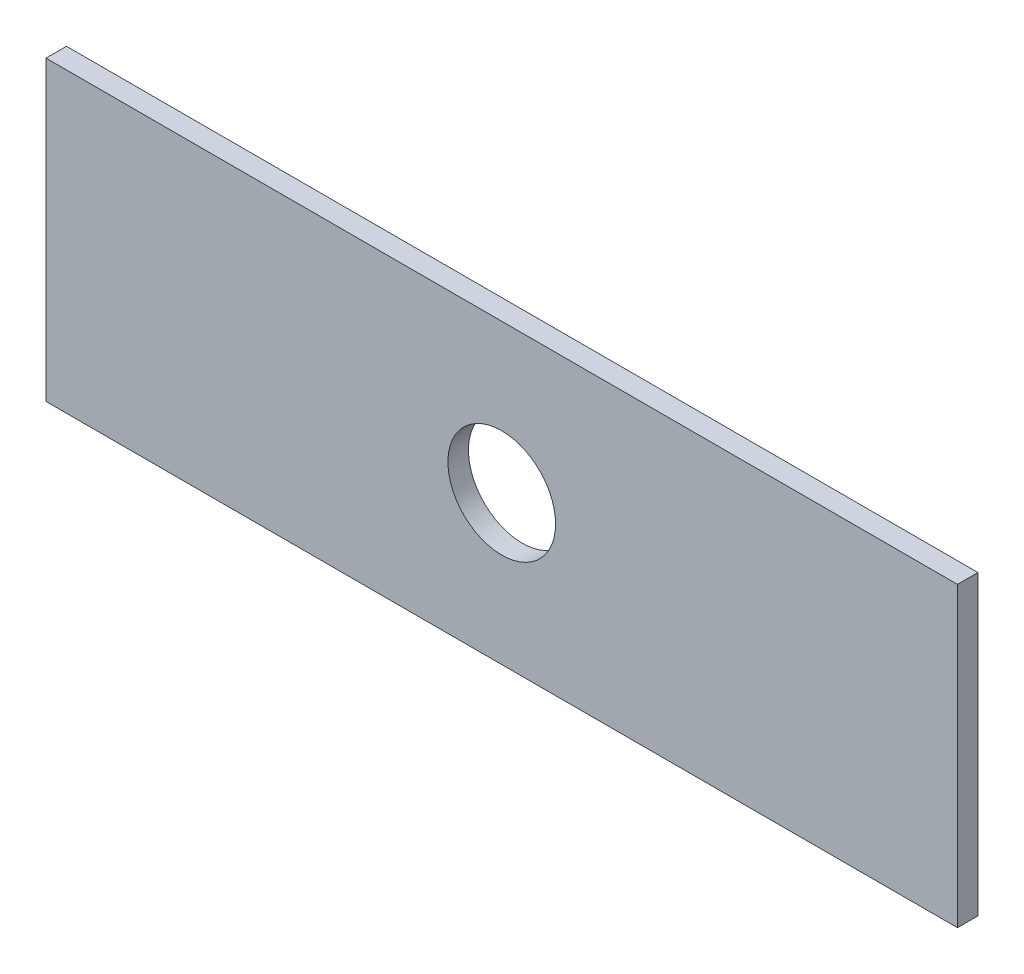
ISO-10303-21;
HEADER;
FILE_DESCRIPTION(('STEP AP214'),'2;1');
FILE_NAME('part.step','',(''),(''),'','','');
FILE_SCHEMA(('AUTOMOTIVE_DESIGN { 1 0 10303 214 1 1 1 1 }'));
ENDSEC;
DATA;
#1=APPLICATION_CONTEXT('core data for automotive mechanical design processes');
#2=APPLICATION_PROTOCOL_DEFINITION('international standard','automotive_design',2000,#1);
#3=PRODUCT_CONTEXT('',#1,'mechanical');
#4=PRODUCT('Part','Part','',(#3));
#5=PRODUCT_RELATED_PRODUCT_CATEGORY('part','',(#4));
#6=PRODUCT_DEFINITION_FORMATION('','',#4);
#7=PRODUCT_DEFINITION_CONTEXT('part definition',#1,'design');
#8=PRODUCT_DEFINITION('design','',#6,#7);
#9=PRODUCT_DEFINITION_SHAPE('','',#8);
#10=(LENGTH_UNIT() NAMED_UNIT(*) SI_UNIT(.MILLI.,.METRE.));
#11=(NAMED_UNIT(*) PLANE_ANGLE_UNIT() SI_UNIT($,.RADIAN.));
#12=(NAMED_UNIT(*) SI_UNIT($,.STERADIAN.) SOLID_ANGLE_UNIT());
#13=UNCERTAINTY_MEASURE_WITH_UNIT(LENGTH_MEASURE(1.E-05),#10,'distance_accuracy_value','');
#14=(GEOMETRIC_REPRESENTATION_CONTEXT(3) GLOBAL_UNCERTAINTY_ASSIGNED_CONTEXT((#13)) GLOBAL_UNIT_ASSIGNED_CONTEXT((#10,
#11,#12)) REPRESENTATION_CONTEXT('',''));
#15=CARTESIAN_POINT('',(0.,0.,0.));
#16=DIRECTION('',(0.,0.,1.));
#17=DIRECTION('',(1.,0.,0.));
#18=AXIS2_PLACEMENT_3D('',#15,#16,#17);
#19=CARTESIAN_POINT('',(-83.6741450916128,29.1859808723421,4.));
#20=DIRECTION('',(1.,0.,0.));
#21=DIRECTION('',(0.,0.,-1.));
#22=AXIS2_PLACEMENT_3D('',#19,#20,#21);
#23=PLANE('',#22);
#24=DIRECTION('',(0.,-1.,0.));
#25=VECTOR('',#24,1.);
#26=CARTESIAN_POINT('',(-83.6741450916128,29.1859808723421,0.));
#27=LINE('',#26,#25);
#28=CARTESIAN_POINT('',(-83.6741450916128,29.1859808723421,0.));
#29=VERTEX_POINT('',#28);
#30=CARTESIAN_POINT('',(-83.6741450916128,-28.814019127658,0.));
#31=VERTEX_POINT('',#30);
#32=EDGE_CURVE('E95',#29,#31,#27,.T.);
#33=ORIENTED_EDGE('',*,*,#32,.T.);
#34=DIRECTION('',(0.,0.,-1.));
#35=VECTOR('',#34,1.);
#36=CARTESIAN_POINT('',(-83.6741450916128,-28.814019127658,4.));
#37=LINE('',#36,#35);
#38=CARTESIAN_POINT('',(-83.6741450916128,-28.814019127658,4.));
#39=VERTEX_POINT('',#38);
#40=EDGE_CURVE('E11',#39,#31,#37,.T.);
#41=ORIENTED_EDGE('',*,*,#40,.F.);
#42=DIRECTION('',(0.,-1.,0.));
#43=VECTOR('',#42,1.);
#44=CARTESIAN_POINT('',(-83.6741450916128,29.1859808723421,4.));
#45=LINE('',#44,#43);
#46=CARTESIAN_POINT('',(-83.6741450916128,29.1859808723421,4.));
#47=VERTEX_POINT('',#46);
#48=EDGE_CURVE('E83',#47,#39,#45,.T.);
#49=ORIENTED_EDGE('',*,*,#48,.F.);
#50=DIRECTION('',(0.,0.,-1.));
#51=VECTOR('',#50,1.);
#52=CARTESIAN_POINT('',(-83.6741450916128,29.1859808723421,4.));
#53=LINE('',#52,#51);
#54=EDGE_CURVE('E91',#47,#29,#53,.T.);
#55=ORIENTED_EDGE('',*,*,#54,.T.);
#56=EDGE_LOOP('',(#33,#41,#49,#55));
#57=FACE_BOUND('',#56,.T.);
#58=ADVANCED_FACE('F32',(#57),#23,.F.);
#59=CARTESIAN_POINT('',(-83.6741450916128,-28.814019127658,4.));
#60=DIRECTION('',(0.,1.,0.));
#61=DIRECTION('',(0.,0.,1.));
#62=AXIS2_PLACEMENT_3D('',#59,#60,#61);
#63=PLANE('',#62);
#64=DIRECTION('',(1.,0.,0.));
#65=VECTOR('',#64,1.);
#66=CARTESIAN_POINT('',(-83.6741450916128,-28.814019127658,0.));
#67=LINE('',#66,#65);
#68=CARTESIAN_POINT('',(94.1258549083872,-28.814019127658,0.));
#69=VERTEX_POINT('',#68);
#70=EDGE_CURVE('E87',#31,#69,#67,.T.);
#71=ORIENTED_EDGE('',*,*,#70,.T.);
#72=DIRECTION('',(0.,0.,-1.));
#73=VECTOR('',#72,1.);
#74=CARTESIAN_POINT('',(94.1258549083872,-28.814019127658,4.));
#75=LINE('',#74,#73);
#76=CARTESIAN_POINT('',(94.1258549083872,-28.814019127658,4.));
#77=VERTEX_POINT('',#76);
#78=EDGE_CURVE('E40',#77,#69,#75,.T.);
#79=ORIENTED_EDGE('',*,*,#78,.F.);
#80=DIRECTION('',(1.,0.,0.));
#81=VECTOR('',#80,1.);
#82=CARTESIAN_POINT('',(-83.6741450916128,-28.814019127658,4.));
#83=LINE('',#82,#81);
#84=EDGE_CURVE('E78',#39,#77,#83,.T.);
#85=ORIENTED_EDGE('',*,*,#84,.F.);
#86=ORIENTED_EDGE('',*,*,#40,.T.);
#87=EDGE_LOOP('',(#71,#79,#85,#86));
#88=FACE_BOUND('',#87,.T.);
#89=ADVANCED_FACE('F86',(#88),#63,.F.);
#90=CARTESIAN_POINT('',(94.1258549083872,29.1859808723421,4.));
#91=DIRECTION('',(-1.,0.,0.));
#92=DIRECTION('',(0.,0.,1.));
#93=AXIS2_PLACEMENT_3D('',#90,#91,#92);
#94=PLANE('',#93);
#95=DIRECTION('',(0.,1.,0.));
#96=VECTOR('',#95,1.);
#97=CARTESIAN_POINT('',(94.1258549083872,29.1859808723421,0.));
#98=LINE('',#97,#96);
#99=CARTESIAN_POINT('',(94.1258549083872,29.1859808723421,0.));
#100=VERTEX_POINT('',#99);
#101=EDGE_CURVE('E65',#69,#100,#98,.T.);
#102=ORIENTED_EDGE('',*,*,#101,.T.);
#103=DIRECTION('',(0.,0.,-1.));
#104=VECTOR('',#103,1.);
#105=CARTESIAN_POINT('',(94.1258549083872,29.1859808723421,4.));
#106=LINE('',#105,#104);
#107=CARTESIAN_POINT('',(94.1258549083872,29.1859808723421,4.));
#108=VERTEX_POINT('',#107);
#109=EDGE_CURVE('E88',#108,#100,#106,.T.);
#110=ORIENTED_EDGE('',*,*,#109,.F.);
#111=DIRECTION('',(0.,1.,0.));
#112=VECTOR('',#111,1.);
#113=CARTESIAN_POINT('',(94.1258549083872,29.1859808723421,4.));
#114=LINE('',#113,#112);
#115=EDGE_CURVE('E81',#77,#108,#114,.T.);
#116=ORIENTED_EDGE('',*,*,#115,.F.);
#117=ORIENTED_EDGE('',*,*,#78,.T.);
#118=EDGE_LOOP('',(#102,#110,#116,#117));
#119=FACE_BOUND('',#118,.T.);
#120=ADVANCED_FACE('F89',(#119),#94,.F.);
#121=CARTESIAN_POINT('',(-83.6741450916128,29.1859808723421,4.));
#122=DIRECTION('',(0.,-1.,0.));
#123=DIRECTION('',(0.,0.,-1.));
#124=AXIS2_PLACEMENT_3D('',#121,#122,#123);
#125=PLANE('',#124);
#126=DIRECTION('',(-1.,0.,0.));
#127=VECTOR('',#126,1.);
#128=CARTESIAN_POINT('',(-83.6741450916128,29.1859808723421,0.));
#129=LINE('',#128,#127);
#130=EDGE_CURVE('E71',#100,#29,#129,.T.);
#131=ORIENTED_EDGE('',*,*,#130,.T.);
#132=ORIENTED_EDGE('',*,*,#54,.F.);
#133=DIRECTION('',(-1.,0.,0.));
#134=VECTOR('',#133,1.);
#135=CARTESIAN_POINT('',(-83.6741450916128,29.1859808723421,4.));
#136=LINE('',#135,#134);
#137=EDGE_CURVE('E48',#108,#47,#136,.T.);
#138=ORIENTED_EDGE('',*,*,#137,.F.);
#139=ORIENTED_EDGE('',*,*,#109,.T.);
#140=EDGE_LOOP('',(#131,#132,#138,#139));
#141=FACE_BOUND('',#140,.T.);
#142=ADVANCED_FACE('F103',(#141),#125,.F.);
#143=CARTESIAN_POINT('',(0.,0.,4.));
#144=DIRECTION('',(0.,0.,1.));
#145=DIRECTION('',(1.,0.,0.));
#146=AXIS2_PLACEMENT_3D('',#143,#144,#145);
#147=PLANE('',#146);
#148=CARTESIAN_POINT('',(5.22585490838719,0.185980872342062,4.));
#149=DIRECTION('',(0.,0.,1.));
#150=DIRECTION('',(1.,0.,0.));
#151=AXIS2_PLACEMENT_3D('',#148,#149,#150);
#152=CIRCLE('',#151,10.5);
#153=CARTESIAN_POINT('',(15.7258549083872,0.185980872342062,4.));
#154=VERTEX_POINT('',#153);
#155=EDGE_CURVE('E111',#154,#154,#152,.T.);
#156=ORIENTED_EDGE('',*,*,#155,.F.);
#157=EDGE_LOOP('',(#156));
#158=FACE_BOUND('',#157,.T.);
#159=ORIENTED_EDGE('',*,*,#48,.T.);
#160=ORIENTED_EDGE('',*,*,#84,.T.);
#161=ORIENTED_EDGE('',*,*,#115,.T.);
#162=ORIENTED_EDGE('',*,*,#137,.T.);
#163=EDGE_LOOP('',(#159,#160,#161,#162));
#164=FACE_BOUND('',#163,.T.);
#165=ADVANCED_FACE('F79',(#158,#164),#147,.T.);
#166=CARTESIAN_POINT('',(0.,0.,0.));
#167=DIRECTION('',(0.,0.,1.));
#168=DIRECTION('',(1.,0.,0.));
#169=AXIS2_PLACEMENT_3D('',#166,#167,#168);
#170=PLANE('',#169);
#171=CARTESIAN_POINT('',(5.22585490838719,0.185980872342062,0.));
#172=DIRECTION('',(0.,0.,1.));
#173=DIRECTION('',(1.,0.,0.));
#174=AXIS2_PLACEMENT_3D('',#171,#172,#173);
#175=CIRCLE('',#174,10.5);
#176=CARTESIAN_POINT('',(15.7258549083872,0.185980872342062,0.));
#177=VERTEX_POINT('',#176);
#178=EDGE_CURVE('E98',#177,#177,#175,.F.);
#179=ORIENTED_EDGE('',*,*,#178,.F.);
#180=EDGE_LOOP('',(#179));
#181=FACE_BOUND('',#180,.T.);
#182=ORIENTED_EDGE('',*,*,#32,.F.);
#183=ORIENTED_EDGE('',*,*,#130,.F.);
#184=ORIENTED_EDGE('',*,*,#101,.F.);
#185=ORIENTED_EDGE('',*,*,#70,.F.);
#186=EDGE_LOOP('',(#182,#183,#184,#185));
#187=FACE_BOUND('',#186,.T.);
#188=ADVANCED_FACE('F106',(#181,#187),#170,.F.);
#189=CARTESIAN_POINT('',(5.22585490838719,0.185980872342062,-0.00100000000000013));
#190=DIRECTION('',(0.,0.,1.));
#191=DIRECTION('',(1.,0.,0.));
#192=AXIS2_PLACEMENT_3D('',#189,#190,#191);
#193=CYLINDRICAL_SURFACE('',#192,10.5);
#194=ORIENTED_EDGE('',*,*,#155,.T.);
#195=EDGE_LOOP('',(#194));
#196=FACE_BOUND('',#195,.T.);
#197=ORIENTED_EDGE('',*,*,#178,.T.);
#198=EDGE_LOOP('',(#197));
#199=FACE_BOUND('',#198,.T.);
#200=ADVANCED_FACE('F115',(#196,#199),#193,.F.);
#201=CLOSED_SHELL('',(#58,#89,#120,#142,#165,#188,#200));
#202=MANIFOLD_SOLID_BREP('B2',#201);
#203=ADVANCED_BREP_SHAPE_REPRESENTATION('',(#18,#202),#14);
#204=SHAPE_DEFINITION_REPRESENTATION(#9,#203);
ENDSEC;
END-ISO-10303-21;
